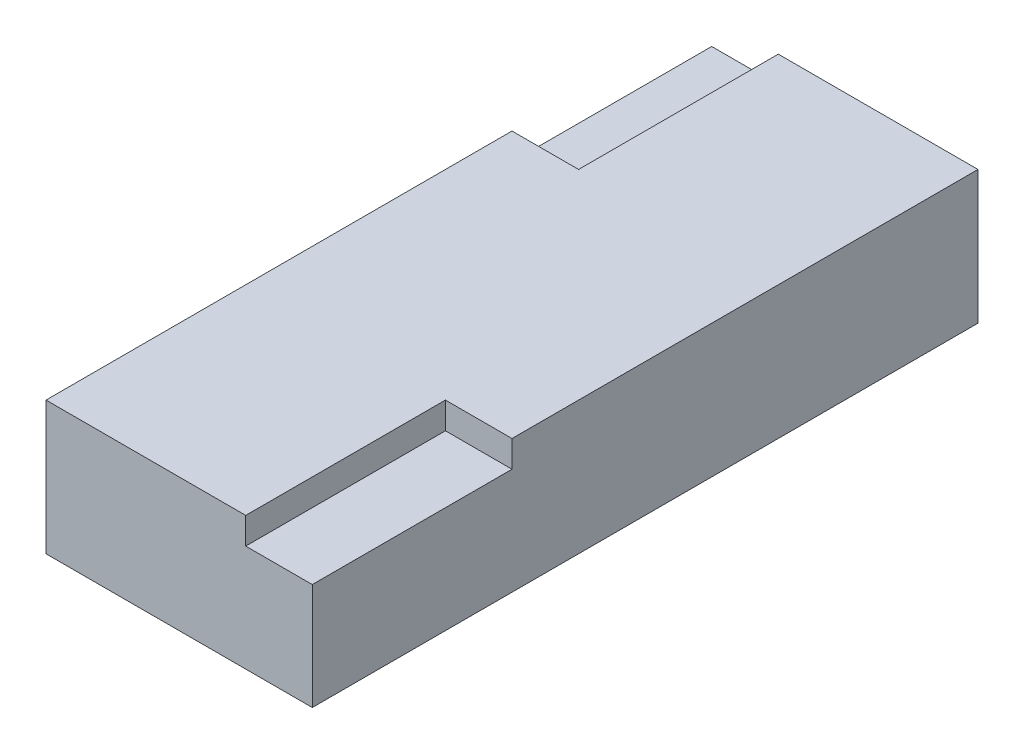
ISO-10303-21;
HEADER;
FILE_DESCRIPTION(('STEP AP214'),'2;1');
FILE_NAME('part.step','',(''),(''),'','','');
FILE_SCHEMA(('AUTOMOTIVE_DESIGN { 1 0 10303 214 1 1 1 1 }'));
ENDSEC;
DATA;
#1=APPLICATION_CONTEXT('core data for automotive mechanical design processes');
#2=APPLICATION_PROTOCOL_DEFINITION('international standard','automotive_design',2000,#1);
#3=PRODUCT_CONTEXT('',#1,'mechanical');
#4=PRODUCT('Part','Part','',(#3));
#5=PRODUCT_RELATED_PRODUCT_CATEGORY('part','',(#4));
#6=PRODUCT_DEFINITION_FORMATION('','',#4);
#7=PRODUCT_DEFINITION_CONTEXT('part definition',#1,'design');
#8=PRODUCT_DEFINITION('design','',#6,#7);
#9=PRODUCT_DEFINITION_SHAPE('','',#8);
#10=(LENGTH_UNIT() NAMED_UNIT(*) SI_UNIT(.MILLI.,.METRE.));
#11=(NAMED_UNIT(*) PLANE_ANGLE_UNIT() SI_UNIT($,.RADIAN.));
#12=(NAMED_UNIT(*) SI_UNIT($,.STERADIAN.) SOLID_ANGLE_UNIT());
#13=UNCERTAINTY_MEASURE_WITH_UNIT(LENGTH_MEASURE(1.E-05),#10,'distance_accuracy_value','');
#14=(GEOMETRIC_REPRESENTATION_CONTEXT(3) GLOBAL_UNCERTAINTY_ASSIGNED_CONTEXT((#13)) GLOBAL_UNIT_ASSIGNED_CONTEXT((#10,
#11,#12)) REPRESENTATION_CONTEXT('',''));
#15=CARTESIAN_POINT('',(0.,0.,0.));
#16=DIRECTION('',(0.,0.,1.));
#17=DIRECTION('',(1.,0.,0.));
#18=AXIS2_PLACEMENT_3D('',#15,#16,#17);
#19=CARTESIAN_POINT('',(0.,10.,0.));
#20=DIRECTION('',(1.,0.,0.));
#21=DIRECTION('',(0.,0.,-1.));
#22=AXIS2_PLACEMENT_3D('',#19,#20,#21);
#23=PLANE('',#22);
#24=DIRECTION('',(0.,0.,1.));
#25=VECTOR('',#24,1.);
#26=CARTESIAN_POINT('',(0.,10.,0.));
#27=LINE('',#26,#25);
#28=CARTESIAN_POINT('',(0.,10.,-35.));
#29=VERTEX_POINT('',#28);
#30=CARTESIAN_POINT('',(0.,10.,0.));
#31=VERTEX_POINT('',#30);
#32=EDGE_CURVE('E169',#29,#31,#27,.T.);
#33=ORIENTED_EDGE('',*,*,#32,.F.);
#34=DIRECTION('',(0.,1.,0.));
#35=VECTOR('',#34,1.);
#36=CARTESIAN_POINT('',(0.,8.,-35.));
#37=LINE('',#36,#35);
#38=CARTESIAN_POINT('',(0.,8.,-35.));
#39=VERTEX_POINT('',#38);
#40=EDGE_CURVE('E65',#39,#29,#37,.T.);
#41=ORIENTED_EDGE('',*,*,#40,.F.);
#42=DIRECTION('',(0.,0.,1.));
#43=VECTOR('',#42,1.);
#44=CARTESIAN_POINT('',(0.,8.,-50.));
#45=LINE('',#44,#43);
#46=CARTESIAN_POINT('',(0.,8.,-50.));
#47=VERTEX_POINT('',#46);
#48=EDGE_CURVE('E147',#47,#39,#45,.T.);
#49=ORIENTED_EDGE('',*,*,#48,.F.);
#50=DIRECTION('',(0.,-1.,0.));
#51=VECTOR('',#50,1.);
#52=CARTESIAN_POINT('',(0.,10.,-50.));
#53=LINE('',#52,#51);
#54=CARTESIAN_POINT('',(0.,0.,-50.));
#55=VERTEX_POINT('',#54);
#56=EDGE_CURVE('E179',#47,#55,#53,.T.);
#57=ORIENTED_EDGE('',*,*,#56,.T.);
#58=DIRECTION('',(0.,0.,1.));
#59=VECTOR('',#58,1.);
#60=CARTESIAN_POINT('',(0.,0.,0.));
#61=LINE('',#60,#59);
#62=CARTESIAN_POINT('',(0.,0.,0.));
#63=VERTEX_POINT('',#62);
#64=EDGE_CURVE('E180',#55,#63,#61,.T.);
#65=ORIENTED_EDGE('',*,*,#64,.T.);
#66=DIRECTION('',(0.,-1.,0.));
#67=VECTOR('',#66,1.);
#68=CARTESIAN_POINT('',(0.,10.,0.));
#69=LINE('',#68,#67);
#70=EDGE_CURVE('E11',#31,#63,#69,.T.);
#71=ORIENTED_EDGE('',*,*,#70,.F.);
#72=EDGE_LOOP('',(#33,#41,#49,#57,#65,#71));
#73=FACE_BOUND('',#72,.T.);
#74=ADVANCED_FACE('F43',(#73),#23,.F.);
#75=CARTESIAN_POINT('',(0.,10.,0.));
#76=DIRECTION('',(0.,0.,-1.));
#77=DIRECTION('',(-1.,0.,0.));
#78=AXIS2_PLACEMENT_3D('',#75,#76,#77);
#79=PLANE('',#78);
#80=DIRECTION('',(1.,0.,0.));
#81=VECTOR('',#80,1.);
#82=CARTESIAN_POINT('',(20.,8.,0.));
#83=LINE('',#82,#81);
#84=CARTESIAN_POINT('',(15.,8.,0.));
#85=VERTEX_POINT('',#84);
#86=CARTESIAN_POINT('',(20.,8.,0.));
#87=VERTEX_POINT('',#86);
#88=EDGE_CURVE('E132',#85,#87,#83,.T.);
#89=ORIENTED_EDGE('',*,*,#88,.F.);
#90=DIRECTION('',(0.,1.,0.));
#91=VECTOR('',#90,1.);
#92=CARTESIAN_POINT('',(15.,8.,0.));
#93=LINE('',#92,#91);
#94=CARTESIAN_POINT('',(15.,10.,0.));
#95=VERTEX_POINT('',#94);
#96=EDGE_CURVE('E142',#85,#95,#93,.T.);
#97=ORIENTED_EDGE('',*,*,#96,.T.);
#98=DIRECTION('',(1.,0.,0.));
#99=VECTOR('',#98,1.);
#100=CARTESIAN_POINT('',(0.,10.,0.));
#101=LINE('',#100,#99);
#102=EDGE_CURVE('E171',#31,#95,#101,.T.);
#103=ORIENTED_EDGE('',*,*,#102,.F.);
#104=ORIENTED_EDGE('',*,*,#70,.T.);
#105=DIRECTION('',(1.,0.,0.));
#106=VECTOR('',#105,1.);
#107=CARTESIAN_POINT('',(0.,0.,0.));
#108=LINE('',#107,#106);
#109=CARTESIAN_POINT('',(20.,0.,0.));
#110=VERTEX_POINT('',#109);
#111=EDGE_CURVE('E183',#63,#110,#108,.T.);
#112=ORIENTED_EDGE('',*,*,#111,.T.);
#113=DIRECTION('',(0.,-1.,0.));
#114=VECTOR('',#113,1.);
#115=CARTESIAN_POINT('',(20.,10.,0.));
#116=LINE('',#115,#114);
#117=EDGE_CURVE('E50',#87,#110,#116,.T.);
#118=ORIENTED_EDGE('',*,*,#117,.F.);
#119=EDGE_LOOP('',(#89,#97,#103,#104,#112,#118));
#120=FACE_BOUND('',#119,.T.);
#121=ADVANCED_FACE('F195',(#120),#79,.F.);
#122=CARTESIAN_POINT('',(20.,10.,0.));
#123=DIRECTION('',(-1.,0.,0.));
#124=DIRECTION('',(0.,0.,1.));
#125=AXIS2_PLACEMENT_3D('',#122,#123,#124);
#126=PLANE('',#125);
#127=DIRECTION('',(0.,0.,-1.));
#128=VECTOR('',#127,1.);
#129=CARTESIAN_POINT('',(20.,10.,0.));
#130=LINE('',#129,#128);
#131=CARTESIAN_POINT('',(20.,10.,-15.));
#132=VERTEX_POINT('',#131);
#133=CARTESIAN_POINT('',(20.,10.,-50.));
#134=VERTEX_POINT('',#133);
#135=EDGE_CURVE('E140',#132,#134,#130,.T.);
#136=ORIENTED_EDGE('',*,*,#135,.F.);
#137=DIRECTION('',(0.,1.,0.));
#138=VECTOR('',#137,1.);
#139=CARTESIAN_POINT('',(20.,8.,-15.));
#140=LINE('',#139,#138);
#141=CARTESIAN_POINT('',(20.,8.,-15.));
#142=VERTEX_POINT('',#141);
#143=EDGE_CURVE('E57',#142,#132,#140,.T.);
#144=ORIENTED_EDGE('',*,*,#143,.F.);
#145=DIRECTION('',(0.,0.,-1.));
#146=VECTOR('',#145,1.);
#147=CARTESIAN_POINT('',(20.,8.,0.));
#148=LINE('',#147,#146);
#149=EDGE_CURVE('E127',#87,#142,#148,.T.);
#150=ORIENTED_EDGE('',*,*,#149,.F.);
#151=ORIENTED_EDGE('',*,*,#117,.T.);
#152=DIRECTION('',(0.,0.,-1.));
#153=VECTOR('',#152,1.);
#154=CARTESIAN_POINT('',(20.,0.,0.));
#155=LINE('',#154,#153);
#156=CARTESIAN_POINT('',(20.,0.,-50.));
#157=VERTEX_POINT('',#156);
#158=EDGE_CURVE('E186',#110,#157,#155,.T.);
#159=ORIENTED_EDGE('',*,*,#158,.T.);
#160=DIRECTION('',(0.,-1.,0.));
#161=VECTOR('',#160,1.);
#162=CARTESIAN_POINT('',(20.,10.,-50.));
#163=LINE('',#162,#161);
#164=EDGE_CURVE('E191',#134,#157,#163,.T.);
#165=ORIENTED_EDGE('',*,*,#164,.F.);
#166=EDGE_LOOP('',(#136,#144,#150,#151,#159,#165));
#167=FACE_BOUND('',#166,.T.);
#168=ADVANCED_FACE('F138',(#167),#126,.F.);
#169=CARTESIAN_POINT('',(0.,10.,-50.));
#170=DIRECTION('',(0.,0.,1.));
#171=DIRECTION('',(1.,0.,0.));
#172=AXIS2_PLACEMENT_3D('',#169,#170,#171);
#173=PLANE('',#172);
#174=DIRECTION('',(-1.,0.,0.));
#175=VECTOR('',#174,1.);
#176=CARTESIAN_POINT('',(0.,8.,-50.));
#177=LINE('',#176,#175);
#178=CARTESIAN_POINT('',(5.,8.,-50.));
#179=VERTEX_POINT('',#178);
#180=EDGE_CURVE('E157',#179,#47,#177,.T.);
#181=ORIENTED_EDGE('',*,*,#180,.F.);
#182=DIRECTION('',(0.,1.,0.));
#183=VECTOR('',#182,1.);
#184=CARTESIAN_POINT('',(5.,8.,-50.));
#185=LINE('',#184,#183);
#186=CARTESIAN_POINT('',(5.,10.,-50.));
#187=VERTEX_POINT('',#186);
#188=EDGE_CURVE('E162',#179,#187,#185,.T.);
#189=ORIENTED_EDGE('',*,*,#188,.T.);
#190=DIRECTION('',(-1.,0.,0.));
#191=VECTOR('',#190,1.);
#192=CARTESIAN_POINT('',(0.,10.,-50.));
#193=LINE('',#192,#191);
#194=EDGE_CURVE('E176',#134,#187,#193,.T.);
#195=ORIENTED_EDGE('',*,*,#194,.F.);
#196=ORIENTED_EDGE('',*,*,#164,.T.);
#197=DIRECTION('',(-1.,0.,0.));
#198=VECTOR('',#197,1.);
#199=CARTESIAN_POINT('',(0.,0.,-50.));
#200=LINE('',#199,#198);
#201=EDGE_CURVE('E172',#157,#55,#200,.T.);
#202=ORIENTED_EDGE('',*,*,#201,.T.);
#203=ORIENTED_EDGE('',*,*,#56,.F.);
#204=EDGE_LOOP('',(#181,#189,#195,#196,#202,#203));
#205=FACE_BOUND('',#204,.T.);
#206=ADVANCED_FACE('F205',(#205),#173,.F.);
#207=CARTESIAN_POINT('',(0.,10.,0.));
#208=DIRECTION('',(0.,-1.,0.));
#209=DIRECTION('',(0.,0.,-1.));
#210=AXIS2_PLACEMENT_3D('',#207,#208,#209);
#211=PLANE('',#210);
#212=ORIENTED_EDGE('',*,*,#102,.T.);
#213=DIRECTION('',(0.,0.,1.));
#214=VECTOR('',#213,1.);
#215=CARTESIAN_POINT('',(15.,10.,0.));
#216=LINE('',#215,#214);
#217=CARTESIAN_POINT('',(15.,10.,-15.));
#218=VERTEX_POINT('',#217);
#219=EDGE_CURVE('E135',#218,#95,#216,.T.);
#220=ORIENTED_EDGE('',*,*,#219,.F.);
#221=DIRECTION('',(-1.,0.,0.));
#222=VECTOR('',#221,1.);
#223=CARTESIAN_POINT('',(20.,10.,-15.));
#224=LINE('',#223,#222);
#225=EDGE_CURVE('E165',#132,#218,#224,.T.);
#226=ORIENTED_EDGE('',*,*,#225,.F.);
#227=ORIENTED_EDGE('',*,*,#135,.T.);
#228=ORIENTED_EDGE('',*,*,#194,.T.);
#229=DIRECTION('',(0.,0.,-1.));
#230=VECTOR('',#229,1.);
#231=CARTESIAN_POINT('',(5.,10.,-50.));
#232=LINE('',#231,#230);
#233=CARTESIAN_POINT('',(5.,10.,-35.));
#234=VERTEX_POINT('',#233);
#235=EDGE_CURVE('E151',#234,#187,#232,.T.);
#236=ORIENTED_EDGE('',*,*,#235,.F.);
#237=DIRECTION('',(1.,0.,0.));
#238=VECTOR('',#237,1.);
#239=CARTESIAN_POINT('',(0.,10.,-35.));
#240=LINE('',#239,#238);
#241=EDGE_CURVE('E159',#29,#234,#240,.T.);
#242=ORIENTED_EDGE('',*,*,#241,.F.);
#243=ORIENTED_EDGE('',*,*,#32,.T.);
#244=EDGE_LOOP('',(#212,#220,#226,#227,#228,#236,#242,#243));
#245=FACE_BOUND('',#244,.T.);
#246=ADVANCED_FACE('F209',(#245),#211,.F.);
#247=CARTESIAN_POINT('',(0.,0.,0.));
#248=DIRECTION('',(0.,-1.,0.));
#249=DIRECTION('',(0.,0.,-1.));
#250=AXIS2_PLACEMENT_3D('',#247,#248,#249);
#251=PLANE('',#250);
#252=ORIENTED_EDGE('',*,*,#64,.F.);
#253=ORIENTED_EDGE('',*,*,#201,.F.);
#254=ORIENTED_EDGE('',*,*,#158,.F.);
#255=ORIENTED_EDGE('',*,*,#111,.F.);
#256=EDGE_LOOP('',(#252,#253,#254,#255));
#257=FACE_BOUND('',#256,.T.);
#258=ADVANCED_FACE('F201',(#257),#251,.T.);
#259=CARTESIAN_POINT('',(5.,8.,-50.));
#260=DIRECTION('',(1.,0.,0.));
#261=DIRECTION('',(0.,0.,-1.));
#262=AXIS2_PLACEMENT_3D('',#259,#260,#261);
#263=PLANE('',#262);
#264=ORIENTED_EDGE('',*,*,#235,.T.);
#265=ORIENTED_EDGE('',*,*,#188,.F.);
#266=DIRECTION('',(0.,0.,-1.));
#267=VECTOR('',#266,1.);
#268=CARTESIAN_POINT('',(5.,8.,-50.));
#269=LINE('',#268,#267);
#270=CARTESIAN_POINT('',(5.,8.,-35.));
#271=VERTEX_POINT('',#270);
#272=EDGE_CURVE('E154',#271,#179,#269,.T.);
#273=ORIENTED_EDGE('',*,*,#272,.F.);
#274=DIRECTION('',(0.,1.,0.));
#275=VECTOR('',#274,1.);
#276=CARTESIAN_POINT('',(5.,8.,-35.));
#277=LINE('',#276,#275);
#278=EDGE_CURVE('E166',#271,#234,#277,.T.);
#279=ORIENTED_EDGE('',*,*,#278,.T.);
#280=EDGE_LOOP('',(#264,#265,#273,#279));
#281=FACE_BOUND('',#280,.T.);
#282=ADVANCED_FACE('F223',(#281),#263,.F.);
#283=CARTESIAN_POINT('',(0.,8.,-35.));
#284=DIRECTION('',(0.,0.,1.));
#285=DIRECTION('',(1.,0.,0.));
#286=AXIS2_PLACEMENT_3D('',#283,#284,#285);
#287=PLANE('',#286);
#288=ORIENTED_EDGE('',*,*,#241,.T.);
#289=ORIENTED_EDGE('',*,*,#278,.F.);
#290=DIRECTION('',(1.,0.,0.));
#291=VECTOR('',#290,1.);
#292=CARTESIAN_POINT('',(0.,8.,-35.));
#293=LINE('',#292,#291);
#294=EDGE_CURVE('E150',#39,#271,#293,.T.);
#295=ORIENTED_EDGE('',*,*,#294,.F.);
#296=ORIENTED_EDGE('',*,*,#40,.T.);
#297=EDGE_LOOP('',(#288,#289,#295,#296));
#298=FACE_BOUND('',#297,.T.);
#299=ADVANCED_FACE('F224',(#298),#287,.F.);
#300=CARTESIAN_POINT('',(0.,8.,0.));
#301=DIRECTION('',(0.,1.,0.));
#302=DIRECTION('',(0.,0.,1.));
#303=AXIS2_PLACEMENT_3D('',#300,#301,#302);
#304=PLANE('',#303);
#305=ORIENTED_EDGE('',*,*,#48,.T.);
#306=ORIENTED_EDGE('',*,*,#294,.T.);
#307=ORIENTED_EDGE('',*,*,#272,.T.);
#308=ORIENTED_EDGE('',*,*,#180,.T.);
#309=EDGE_LOOP('',(#305,#306,#307,#308));
#310=FACE_BOUND('',#309,.T.);
#311=ADVANCED_FACE('F220',(#310),#304,.T.);
#312=CARTESIAN_POINT('',(15.,8.,0.));
#313=DIRECTION('',(-1.,0.,0.));
#314=DIRECTION('',(0.,0.,1.));
#315=AXIS2_PLACEMENT_3D('',#312,#313,#314);
#316=PLANE('',#315);
#317=ORIENTED_EDGE('',*,*,#219,.T.);
#318=ORIENTED_EDGE('',*,*,#96,.F.);
#319=DIRECTION('',(0.,0.,1.));
#320=VECTOR('',#319,1.);
#321=CARTESIAN_POINT('',(15.,8.,0.));
#322=LINE('',#321,#320);
#323=CARTESIAN_POINT('',(15.,8.,-15.));
#324=VERTEX_POINT('',#323);
#325=EDGE_CURVE('E126',#324,#85,#322,.T.);
#326=ORIENTED_EDGE('',*,*,#325,.F.);
#327=DIRECTION('',(0.,1.,0.));
#328=VECTOR('',#327,1.);
#329=CARTESIAN_POINT('',(15.,8.,-15.));
#330=LINE('',#329,#328);
#331=EDGE_CURVE('E122',#324,#218,#330,.T.);
#332=ORIENTED_EDGE('',*,*,#331,.T.);
#333=EDGE_LOOP('',(#317,#318,#326,#332));
#334=FACE_BOUND('',#333,.T.);
#335=ADVANCED_FACE('F229',(#334),#316,.F.);
#336=CARTESIAN_POINT('',(20.,8.,-15.));
#337=DIRECTION('',(0.,0.,-1.));
#338=DIRECTION('',(-1.,0.,0.));
#339=AXIS2_PLACEMENT_3D('',#336,#337,#338);
#340=PLANE('',#339);
#341=ORIENTED_EDGE('',*,*,#225,.T.);
#342=ORIENTED_EDGE('',*,*,#331,.F.);
#343=DIRECTION('',(-1.,0.,0.));
#344=VECTOR('',#343,1.);
#345=CARTESIAN_POINT('',(20.,8.,-15.));
#346=LINE('',#345,#344);
#347=EDGE_CURVE('E119',#142,#324,#346,.T.);
#348=ORIENTED_EDGE('',*,*,#347,.F.);
#349=ORIENTED_EDGE('',*,*,#143,.T.);
#350=EDGE_LOOP('',(#341,#342,#348,#349));
#351=FACE_BOUND('',#350,.T.);
#352=ADVANCED_FACE('F121',(#351),#340,.F.);
#353=CARTESIAN_POINT('',(0.,8.,0.));
#354=DIRECTION('',(0.,1.,0.));
#355=DIRECTION('',(0.,0.,1.));
#356=AXIS2_PLACEMENT_3D('',#353,#354,#355);
#357=PLANE('',#356);
#358=ORIENTED_EDGE('',*,*,#149,.T.);
#359=ORIENTED_EDGE('',*,*,#347,.T.);
#360=ORIENTED_EDGE('',*,*,#325,.T.);
#361=ORIENTED_EDGE('',*,*,#88,.T.);
#362=EDGE_LOOP('',(#358,#359,#360,#361));
#363=FACE_BOUND('',#362,.T.);
#364=ADVANCED_FACE('F130',(#363),#357,.T.);
#365=CLOSED_SHELL('',(#74,#121,#168,#206,#246,#258,#282,#299,#311,#335,#352,#364));
#366=MANIFOLD_SOLID_BREP('B2',#365);
#367=ADVANCED_BREP_SHAPE_REPRESENTATION('',(#18,#366),#14);
#368=SHAPE_DEFINITION_REPRESENTATION(#9,#367);
ENDSEC;
END-ISO-10303-21;
